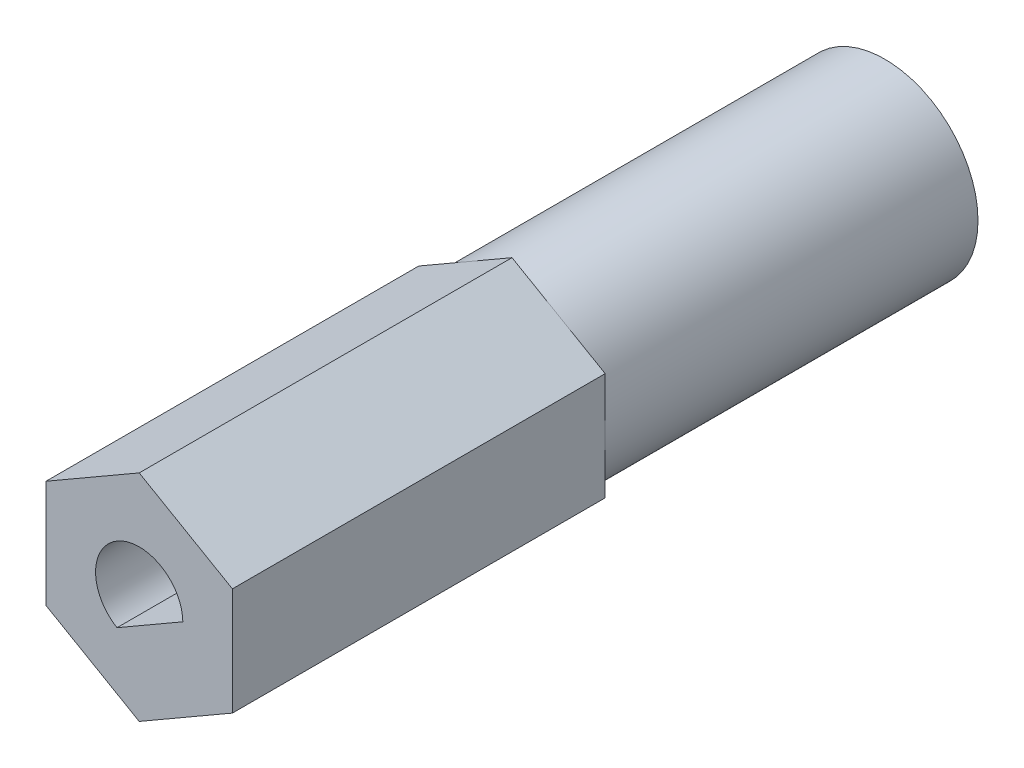
ISO-10303-21;
HEADER;
FILE_DESCRIPTION(('STEP AP214'),'2;1');
FILE_NAME('part.step','',(''),(''),'','','');
FILE_SCHEMA(('AUTOMOTIVE_DESIGN { 1 0 10303 214 1 1 1 1 }'));
ENDSEC;
DATA;
#1=APPLICATION_CONTEXT('core data for automotive mechanical design processes');
#2=APPLICATION_PROTOCOL_DEFINITION('international standard','automotive_design',2000,#1);
#3=PRODUCT_CONTEXT('',#1,'mechanical');
#4=PRODUCT('Part','Part','',(#3));
#5=PRODUCT_RELATED_PRODUCT_CATEGORY('part','',(#4));
#6=PRODUCT_DEFINITION_FORMATION('','',#4);
#7=PRODUCT_DEFINITION_CONTEXT('part definition',#1,'design');
#8=PRODUCT_DEFINITION('design','',#6,#7);
#9=PRODUCT_DEFINITION_SHAPE('','',#8);
#10=(LENGTH_UNIT() NAMED_UNIT(*) SI_UNIT(.MILLI.,.METRE.));
#11=(NAMED_UNIT(*) PLANE_ANGLE_UNIT() SI_UNIT($,.RADIAN.));
#12=(NAMED_UNIT(*) SI_UNIT($,.STERADIAN.) SOLID_ANGLE_UNIT());
#13=UNCERTAINTY_MEASURE_WITH_UNIT(LENGTH_MEASURE(1.E-05),#10,'distance_accuracy_value','');
#14=(GEOMETRIC_REPRESENTATION_CONTEXT(3) GLOBAL_UNCERTAINTY_ASSIGNED_CONTEXT((#13)) GLOBAL_UNIT_ASSIGNED_CONTEXT((#10,
#11,#12)) REPRESENTATION_CONTEXT('',''));
#15=CARTESIAN_POINT('',(0.,0.,0.));
#16=DIRECTION('',(0.,0.,1.));
#17=DIRECTION('',(1.,0.,0.));
#18=AXIS2_PLACEMENT_3D('',#15,#16,#17);
#19=CARTESIAN_POINT('',(3.175,1.83308710467706,-25.4));
#20=DIRECTION('',(0.5,0.866025403784439,0.));
#21=DIRECTION('',(-0.866025403784439,0.5,0.));
#22=AXIS2_PLACEMENT_3D('',#19,#20,#21);
#23=PLANE('',#22);
#24=DIRECTION('',(0.866025403784439,-0.5,0.));
#25=VECTOR('',#24,1.);
#26=CARTESIAN_POINT('',(3.175,1.83308710467706,-12.7));
#27=LINE('',#26,#25);
#28=CARTESIAN_POINT('',(0.,3.66617420935412,-12.7));
#29=VERTEX_POINT('',#28);
#30=CARTESIAN_POINT('',(1.5875,2.74963065701559,-12.7));
#31=VERTEX_POINT('',#30);
#32=EDGE_CURVE('E153',#29,#31,#27,.T.);
#33=ORIENTED_EDGE('',*,*,#32,.F.);
#34=DIRECTION('',(0.,0.,1.));
#35=VECTOR('',#34,1.);
#36=CARTESIAN_POINT('',(0.,3.66617420935412,-25.4));
#37=LINE('',#36,#35);
#38=CARTESIAN_POINT('',(0.,3.66617420935412,0.));
#39=VERTEX_POINT('',#38);
#40=EDGE_CURVE('E186',#29,#39,#37,.T.);
#41=ORIENTED_EDGE('',*,*,#40,.T.);
#42=DIRECTION('',(-0.866025403784439,0.5,0.));
#43=VECTOR('',#42,1.);
#44=CARTESIAN_POINT('',(3.175,1.83308710467706,0.));
#45=LINE('',#44,#43);
#46=CARTESIAN_POINT('',(3.175,1.83308710467706,0.));
#47=VERTEX_POINT('',#46);
#48=EDGE_CURVE('E167',#47,#39,#45,.T.);
#49=ORIENTED_EDGE('',*,*,#48,.F.);
#50=DIRECTION('',(0.,0.,1.));
#51=VECTOR('',#50,1.);
#52=CARTESIAN_POINT('',(3.175,1.83308710467706,-25.4));
#53=LINE('',#52,#51);
#54=CARTESIAN_POINT('',(3.175,1.83308710467706,-12.7));
#55=VERTEX_POINT('',#54);
#56=EDGE_CURVE('E187',#55,#47,#53,.T.);
#57=ORIENTED_EDGE('',*,*,#56,.F.);
#58=EDGE_CURVE('E124',#31,#55,#27,.T.);
#59=ORIENTED_EDGE('',*,*,#58,.F.);
#60=EDGE_LOOP('',(#33,#41,#49,#57,#59));
#61=FACE_BOUND('',#60,.T.);
#62=ADVANCED_FACE('F36',(#61),#23,.T.);
#63=CARTESIAN_POINT('',(3.175,-1.83308710467706,-25.4));
#64=DIRECTION('',(1.,0.,0.));
#65=DIRECTION('',(0.,1.,0.));
#66=AXIS2_PLACEMENT_3D('',#63,#64,#65);
#67=PLANE('',#66);
#68=DIRECTION('',(0.,-1.,0.));
#69=VECTOR('',#68,1.);
#70=CARTESIAN_POINT('',(3.175,-1.83308710467706,-12.7));
#71=LINE('',#70,#69);
#72=CARTESIAN_POINT('',(3.175,0.,-12.7));
#73=VERTEX_POINT('',#72);
#74=EDGE_CURVE('E118',#55,#73,#71,.T.);
#75=ORIENTED_EDGE('',*,*,#74,.F.);
#76=ORIENTED_EDGE('',*,*,#56,.T.);
#77=DIRECTION('',(0.,1.,0.));
#78=VECTOR('',#77,1.);
#79=CARTESIAN_POINT('',(3.175,-1.83308710467706,0.));
#80=LINE('',#79,#78);
#81=CARTESIAN_POINT('',(3.175,-1.83308710467706,0.));
#82=VERTEX_POINT('',#81);
#83=EDGE_CURVE('E183',#82,#47,#80,.T.);
#84=ORIENTED_EDGE('',*,*,#83,.F.);
#85=DIRECTION('',(0.,0.,1.));
#86=VECTOR('',#85,1.);
#87=CARTESIAN_POINT('',(3.175,-1.83308710467706,-25.4));
#88=LINE('',#87,#86);
#89=CARTESIAN_POINT('',(3.175,-1.83308710467706,-12.7));
#90=VERTEX_POINT('',#89);
#91=EDGE_CURVE('E147',#90,#82,#88,.T.);
#92=ORIENTED_EDGE('',*,*,#91,.F.);
#93=EDGE_CURVE('E128',#73,#90,#71,.T.);
#94=ORIENTED_EDGE('',*,*,#93,.F.);
#95=EDGE_LOOP('',(#75,#76,#84,#92,#94));
#96=FACE_BOUND('',#95,.T.);
#97=ADVANCED_FACE('F145',(#96),#67,.T.);
#98=CARTESIAN_POINT('',(0.,-3.66617420935412,-25.4));
#99=DIRECTION('',(0.5,-0.866025403784438,0.));
#100=DIRECTION('',(0.866025403784439,0.5,0.));
#101=AXIS2_PLACEMENT_3D('',#98,#99,#100);
#102=PLANE('',#101);
#103=DIRECTION('',(-0.866025403784439,-0.5,0.));
#104=VECTOR('',#103,1.);
#105=CARTESIAN_POINT('',(0.,-3.66617420935412,-12.7));
#106=LINE('',#105,#104);
#107=CARTESIAN_POINT('',(1.5875,-2.74963065701559,-12.7));
#108=VERTEX_POINT('',#107);
#109=EDGE_CURVE('E135',#90,#108,#106,.T.);
#110=ORIENTED_EDGE('',*,*,#109,.F.);
#111=ORIENTED_EDGE('',*,*,#91,.T.);
#112=DIRECTION('',(0.866025403784439,0.5,0.));
#113=VECTOR('',#112,1.);
#114=CARTESIAN_POINT('',(0.,-3.66617420935412,0.));
#115=LINE('',#114,#113);
#116=CARTESIAN_POINT('',(0.,-3.66617420935412,0.));
#117=VERTEX_POINT('',#116);
#118=EDGE_CURVE('E180',#117,#82,#115,.T.);
#119=ORIENTED_EDGE('',*,*,#118,.F.);
#120=DIRECTION('',(0.,0.,1.));
#121=VECTOR('',#120,1.);
#122=CARTESIAN_POINT('',(0.,-3.66617420935412,-25.4));
#123=LINE('',#122,#121);
#124=CARTESIAN_POINT('',(0.,-3.66617420935412,-12.7));
#125=VERTEX_POINT('',#124);
#126=EDGE_CURVE('E191',#125,#117,#123,.T.);
#127=ORIENTED_EDGE('',*,*,#126,.F.);
#128=EDGE_CURVE('E148',#108,#125,#106,.T.);
#129=ORIENTED_EDGE('',*,*,#128,.F.);
#130=EDGE_LOOP('',(#110,#111,#119,#127,#129));
#131=FACE_BOUND('',#130,.T.);
#132=ADVANCED_FACE('F217',(#131),#102,.T.);
#133=CARTESIAN_POINT('',(-3.175,-1.83308710467706,-25.4));
#134=DIRECTION('',(-0.5,-0.866025403784439,0.));
#135=DIRECTION('',(0.866025403784439,-0.5,0.));
#136=AXIS2_PLACEMENT_3D('',#133,#134,#135);
#137=PLANE('',#136);
#138=DIRECTION('',(-0.866025403784439,0.5,0.));
#139=VECTOR('',#138,1.);
#140=CARTESIAN_POINT('',(-3.175,-1.83308710467706,-12.7));
#141=LINE('',#140,#139);
#142=CARTESIAN_POINT('',(-1.5875,-2.74963065701559,-12.7));
#143=VERTEX_POINT('',#142);
#144=EDGE_CURVE('E221',#125,#143,#141,.T.);
#145=ORIENTED_EDGE('',*,*,#144,.F.);
#146=ORIENTED_EDGE('',*,*,#126,.T.);
#147=DIRECTION('',(0.866025403784439,-0.5,0.));
#148=VECTOR('',#147,1.);
#149=CARTESIAN_POINT('',(-3.175,-1.83308710467706,0.));
#150=LINE('',#149,#148);
#151=CARTESIAN_POINT('',(-3.175,-1.83308710467706,0.));
#152=VERTEX_POINT('',#151);
#153=EDGE_CURVE('E177',#152,#117,#150,.T.);
#154=ORIENTED_EDGE('',*,*,#153,.F.);
#155=DIRECTION('',(0.,0.,1.));
#156=VECTOR('',#155,1.);
#157=CARTESIAN_POINT('',(-3.175,-1.83308710467706,-25.4));
#158=LINE('',#157,#156);
#159=CARTESIAN_POINT('',(-3.175,-1.83308710467706,-12.7));
#160=VERTEX_POINT('',#159);
#161=EDGE_CURVE('E193',#160,#152,#158,.T.);
#162=ORIENTED_EDGE('',*,*,#161,.F.);
#163=EDGE_CURVE('E222',#143,#160,#141,.T.);
#164=ORIENTED_EDGE('',*,*,#163,.F.);
#165=EDGE_LOOP('',(#145,#146,#154,#162,#164));
#166=FACE_BOUND('',#165,.T.);
#167=ADVANCED_FACE('F241',(#166),#137,.T.);
#168=CARTESIAN_POINT('',(-3.175,1.83308710467706,-25.4));
#169=DIRECTION('',(-1.,0.,0.));
#170=DIRECTION('',(0.,-1.,0.));
#171=AXIS2_PLACEMENT_3D('',#168,#169,#170);
#172=PLANE('',#171);
#173=DIRECTION('',(0.,1.,0.));
#174=VECTOR('',#173,1.);
#175=CARTESIAN_POINT('',(-3.175,1.83308710467706,-12.7));
#176=LINE('',#175,#174);
#177=CARTESIAN_POINT('',(-3.175,0.,-12.7));
#178=VERTEX_POINT('',#177);
#179=EDGE_CURVE('E223',#160,#178,#176,.T.);
#180=ORIENTED_EDGE('',*,*,#179,.F.);
#181=ORIENTED_EDGE('',*,*,#161,.T.);
#182=DIRECTION('',(0.,-1.,0.));
#183=VECTOR('',#182,1.);
#184=CARTESIAN_POINT('',(-3.175,1.83308710467706,0.));
#185=LINE('',#184,#183);
#186=CARTESIAN_POINT('',(-3.175,1.83308710467706,0.));
#187=VERTEX_POINT('',#186);
#188=EDGE_CURVE('E174',#187,#152,#185,.T.);
#189=ORIENTED_EDGE('',*,*,#188,.F.);
#190=DIRECTION('',(0.,0.,1.));
#191=VECTOR('',#190,1.);
#192=CARTESIAN_POINT('',(-3.175,1.83308710467706,-25.4));
#193=LINE('',#192,#191);
#194=CARTESIAN_POINT('',(-3.175,1.83308710467706,-12.7));
#195=VERTEX_POINT('',#194);
#196=EDGE_CURVE('E195',#195,#187,#193,.T.);
#197=ORIENTED_EDGE('',*,*,#196,.F.);
#198=EDGE_CURVE('E143',#178,#195,#176,.T.);
#199=ORIENTED_EDGE('',*,*,#198,.F.);
#200=EDGE_LOOP('',(#180,#181,#189,#197,#199));
#201=FACE_BOUND('',#200,.T.);
#202=ADVANCED_FACE('F239',(#201),#172,.T.);
#203=CARTESIAN_POINT('',(0.,3.66617420935412,-25.4));
#204=DIRECTION('',(-0.5,0.866025403784439,0.));
#205=DIRECTION('',(-0.866025403784439,-0.5,0.));
#206=AXIS2_PLACEMENT_3D('',#203,#204,#205);
#207=PLANE('',#206);
#208=DIRECTION('',(0.866025403784439,0.5,0.));
#209=VECTOR('',#208,1.);
#210=CARTESIAN_POINT('',(0.,3.66617420935412,-12.7));
#211=LINE('',#210,#209);
#212=CARTESIAN_POINT('',(-1.5875,2.74963065701559,-12.7));
#213=VERTEX_POINT('',#212);
#214=EDGE_CURVE('E12',#195,#213,#211,.T.);
#215=ORIENTED_EDGE('',*,*,#214,.F.);
#216=ORIENTED_EDGE('',*,*,#196,.T.);
#217=DIRECTION('',(-0.866025403784439,-0.5,0.));
#218=VECTOR('',#217,1.);
#219=CARTESIAN_POINT('',(0.,3.66617420935412,0.));
#220=LINE('',#219,#218);
#221=EDGE_CURVE('E171',#39,#187,#220,.T.);
#222=ORIENTED_EDGE('',*,*,#221,.F.);
#223=ORIENTED_EDGE('',*,*,#40,.F.);
#224=EDGE_CURVE('E39',#213,#29,#211,.T.);
#225=ORIENTED_EDGE('',*,*,#224,.F.);
#226=EDGE_LOOP('',(#215,#216,#222,#223,#225));
#227=FACE_BOUND('',#226,.T.);
#228=ADVANCED_FACE('F208',(#227),#207,.T.);
#229=CARTESIAN_POINT('',(0.,0.,0.));
#230=DIRECTION('',(0.,0.,1.));
#231=DIRECTION('',(1.,0.,0.));
#232=AXIS2_PLACEMENT_3D('',#229,#230,#231);
#233=PLANE('',#232);
#234=CARTESIAN_POINT('',(0.,0.,0.));
#235=DIRECTION('',(0.,0.,1.));
#236=DIRECTION('',(1.,0.,0.));
#237=AXIS2_PLACEMENT_3D('',#234,#235,#236);
#238=CIRCLE('',#237,1.4859);
#239=CARTESIAN_POINT('',(1.4858129807687,0.0160809259445427,0.));
#240=VERTEX_POINT('',#239);
#241=CARTESIAN_POINT('',(-0.7568329807687,-1.2787113236461,0.));
#242=VERTEX_POINT('',#241);
#243=EDGE_CURVE('E58',#240,#242,#238,.T.);
#244=ORIENTED_EDGE('',*,*,#243,.F.);
#245=DIRECTION('',(0.866025403784438,0.5,0.));
#246=VECTOR('',#245,1.);
#247=CARTESIAN_POINT('',(-0.7568329807687,-1.2787113236461,0.));
#248=LINE('',#247,#246);
#249=EDGE_CURVE('E158',#242,#240,#248,.T.);
#250=ORIENTED_EDGE('',*,*,#249,.F.);
#251=EDGE_LOOP('',(#244,#250));
#252=FACE_BOUND('',#251,.T.);
#253=ORIENTED_EDGE('',*,*,#48,.T.);
#254=ORIENTED_EDGE('',*,*,#221,.T.);
#255=ORIENTED_EDGE('',*,*,#188,.T.);
#256=ORIENTED_EDGE('',*,*,#153,.T.);
#257=ORIENTED_EDGE('',*,*,#118,.T.);
#258=ORIENTED_EDGE('',*,*,#83,.T.);
#259=EDGE_LOOP('',(#253,#254,#255,#256,#257,#258));
#260=FACE_BOUND('',#259,.T.);
#261=ADVANCED_FACE('F212',(#252,#260),#233,.T.);
#262=CARTESIAN_POINT('',(0.,0.,-5.08));
#263=DIRECTION('',(0.,0.,1.));
#264=DIRECTION('',(1.,0.,0.));
#265=AXIS2_PLACEMENT_3D('',#262,#263,#264);
#266=CYLINDRICAL_SURFACE('',#265,1.4859);
#267=ORIENTED_EDGE('',*,*,#243,.T.);
#268=DIRECTION('',(0.,0.,1.));
#269=VECTOR('',#268,1.);
#270=CARTESIAN_POINT('',(-0.7568329807687,-1.2787113236461,-5.08));
#271=LINE('',#270,#269);
#272=CARTESIAN_POINT('',(-0.7568329807687,-1.2787113236461,-5.08));
#273=VERTEX_POINT('',#272);
#274=EDGE_CURVE('E161',#273,#242,#271,.T.);
#275=ORIENTED_EDGE('',*,*,#274,.F.);
#276=CARTESIAN_POINT('',(0.,0.,-5.08));
#277=DIRECTION('',(0.,0.,1.));
#278=DIRECTION('',(1.,0.,0.));
#279=AXIS2_PLACEMENT_3D('',#276,#277,#278);
#280=CIRCLE('',#279,1.4859);
#281=CARTESIAN_POINT('',(1.4858129807687,0.0160809259445427,-5.08));
#282=VERTEX_POINT('',#281);
#283=EDGE_CURVE('E154',#282,#273,#280,.T.);
#284=ORIENTED_EDGE('',*,*,#283,.F.);
#285=DIRECTION('',(0.,0.,1.));
#286=VECTOR('',#285,1.);
#287=CARTESIAN_POINT('',(1.4858129807687,0.0160809259445427,-5.08));
#288=LINE('',#287,#286);
#289=EDGE_CURVE('E165',#282,#240,#288,.T.);
#290=ORIENTED_EDGE('',*,*,#289,.T.);
#291=EDGE_LOOP('',(#267,#275,#284,#290));
#292=FACE_BOUND('',#291,.T.);
#293=ADVANCED_FACE('F260',(#292),#266,.F.);
#294=CARTESIAN_POINT('',(-0.7568329807687,-1.2787113236461,-5.08));
#295=DIRECTION('',(0.5,-0.866025403784439,0.));
#296=DIRECTION('',(0.866025403784439,0.5,0.));
#297=AXIS2_PLACEMENT_3D('',#294,#295,#296);
#298=PLANE('',#297);
#299=ORIENTED_EDGE('',*,*,#249,.T.);
#300=ORIENTED_EDGE('',*,*,#289,.F.);
#301=DIRECTION('',(0.866025403784438,0.5,0.));
#302=VECTOR('',#301,1.);
#303=CARTESIAN_POINT('',(-0.7568329807687,-1.2787113236461,-5.08));
#304=LINE('',#303,#302);
#305=EDGE_CURVE('E157',#273,#282,#304,.T.);
#306=ORIENTED_EDGE('',*,*,#305,.F.);
#307=ORIENTED_EDGE('',*,*,#274,.T.);
#308=EDGE_LOOP('',(#299,#300,#306,#307));
#309=FACE_BOUND('',#308,.T.);
#310=ADVANCED_FACE('F268',(#309),#298,.F.);
#311=CARTESIAN_POINT('',(0.,0.,-5.08));
#312=DIRECTION('',(0.,0.,1.));
#313=DIRECTION('',(1.,0.,0.));
#314=AXIS2_PLACEMENT_3D('',#311,#312,#313);
#315=PLANE('',#314);
#316=ORIENTED_EDGE('',*,*,#283,.T.);
#317=ORIENTED_EDGE('',*,*,#305,.T.);
#318=EDGE_LOOP('',(#316,#317));
#319=FACE_BOUND('',#318,.T.);
#320=ADVANCED_FACE('F271',(#319),#315,.T.);
#321=CARTESIAN_POINT('',(0.,0.,-12.7));
#322=DIRECTION('',(0.,0.,1.));
#323=DIRECTION('',(1.,0.,0.));
#324=AXIS2_PLACEMENT_3D('',#321,#322,#323);
#325=PLANE('',#324);
#326=ORIENTED_EDGE('',*,*,#32,.T.);
#327=CARTESIAN_POINT('',(0.,0.,-12.7));
#328=DIRECTION('',(0.,0.,1.));
#329=DIRECTION('',(1.,0.,0.));
#330=AXIS2_PLACEMENT_3D('',#327,#328,#329);
#331=CIRCLE('',#330,3.175);
#332=EDGE_CURVE('E50',#31,#213,#331,.T.);
#333=ORIENTED_EDGE('',*,*,#332,.T.);
#334=ORIENTED_EDGE('',*,*,#224,.T.);
#335=EDGE_LOOP('',(#326,#333,#334));
#336=FACE_BOUND('',#335,.T.);
#337=ADVANCED_FACE('F201',(#336),#325,.F.);
#338=ORIENTED_EDGE('',*,*,#58,.T.);
#339=ORIENTED_EDGE('',*,*,#74,.T.);
#340=EDGE_CURVE('E122',#73,#31,#331,.T.);
#341=ORIENTED_EDGE('',*,*,#340,.T.);
#342=EDGE_LOOP('',(#338,#339,#341));
#343=FACE_BOUND('',#342,.T.);
#344=ADVANCED_FACE('F120',(#343),#325,.F.);
#345=ORIENTED_EDGE('',*,*,#93,.T.);
#346=ORIENTED_EDGE('',*,*,#109,.T.);
#347=EDGE_CURVE('E132',#108,#73,#331,.T.);
#348=ORIENTED_EDGE('',*,*,#347,.T.);
#349=EDGE_LOOP('',(#345,#346,#348));
#350=FACE_BOUND('',#349,.T.);
#351=ADVANCED_FACE('F133',(#350),#325,.F.);
#352=ORIENTED_EDGE('',*,*,#128,.T.);
#353=ORIENTED_EDGE('',*,*,#144,.T.);
#354=EDGE_CURVE('E139',#143,#108,#331,.T.);
#355=ORIENTED_EDGE('',*,*,#354,.T.);
#356=EDGE_LOOP('',(#352,#353,#355));
#357=FACE_BOUND('',#356,.T.);
#358=ADVANCED_FACE('F282',(#357),#325,.F.);
#359=ORIENTED_EDGE('',*,*,#163,.T.);
#360=ORIENTED_EDGE('',*,*,#179,.T.);
#361=EDGE_CURVE('E233',#178,#143,#331,.T.);
#362=ORIENTED_EDGE('',*,*,#361,.T.);
#363=EDGE_LOOP('',(#359,#360,#362));
#364=FACE_BOUND('',#363,.T.);
#365=ADVANCED_FACE('F232',(#364),#325,.F.);
#366=CARTESIAN_POINT('',(0.,0.,-25.4));
#367=DIRECTION('',(0.,0.,1.));
#368=DIRECTION('',(1.,0.,0.));
#369=AXIS2_PLACEMENT_3D('',#366,#367,#368);
#370=CYLINDRICAL_SURFACE('',#369,3.175);
#371=ORIENTED_EDGE('',*,*,#332,.F.);
#372=ORIENTED_EDGE('',*,*,#340,.F.);
#373=ORIENTED_EDGE('',*,*,#347,.F.);
#374=ORIENTED_EDGE('',*,*,#354,.F.);
#375=ORIENTED_EDGE('',*,*,#361,.F.);
#376=EDGE_CURVE('E237',#213,#178,#331,.T.);
#377=ORIENTED_EDGE('',*,*,#376,.F.);
#378=EDGE_LOOP('',(#371,#372,#373,#374,#375,#377));
#379=FACE_BOUND('',#378,.T.);
#380=CARTESIAN_POINT('',(0.,0.,-25.4));
#381=DIRECTION('',(0.,0.,1.));
#382=DIRECTION('',(1.,0.,0.));
#383=AXIS2_PLACEMENT_3D('',#380,#381,#382);
#384=CIRCLE('',#383,3.175);
#385=CARTESIAN_POINT('',(3.175,0.,-25.4));
#386=VERTEX_POINT('',#385);
#387=EDGE_CURVE('E189',#386,#386,#384,.T.);
#388=ORIENTED_EDGE('',*,*,#387,.T.);
#389=EDGE_LOOP('',(#388));
#390=FACE_BOUND('',#389,.T.);
#391=ADVANCED_FACE('F141',(#379,#390),#370,.T.);
#392=ORIENTED_EDGE('',*,*,#198,.T.);
#393=ORIENTED_EDGE('',*,*,#214,.T.);
#394=ORIENTED_EDGE('',*,*,#376,.T.);
#395=EDGE_LOOP('',(#392,#393,#394));
#396=FACE_BOUND('',#395,.T.);
#397=ADVANCED_FACE('F238',(#396),#325,.F.);
#398=CARTESIAN_POINT('',(0.,0.,-25.4));
#399=DIRECTION('',(0.,0.,1.));
#400=DIRECTION('',(1.,0.,0.));
#401=AXIS2_PLACEMENT_3D('',#398,#399,#400);
#402=PLANE('',#401);
#403=ORIENTED_EDGE('',*,*,#387,.F.);
#404=EDGE_LOOP('',(#403));
#405=FACE_BOUND('',#404,.T.);
#406=ADVANCED_FACE('F262',(#405),#402,.F.);
#407=CLOSED_SHELL('',(#62,#97,#132,#167,#202,#228,#261,#293,#310,#320,#337,#344,#351,#358,#365,
#391,#397,#406));
#408=MANIFOLD_SOLID_BREP('B2',#407);
#409=ADVANCED_BREP_SHAPE_REPRESENTATION('',(#18,#408),#14);
#410=SHAPE_DEFINITION_REPRESENTATION(#9,#409);
ENDSEC;
END-ISO-10303-21;
